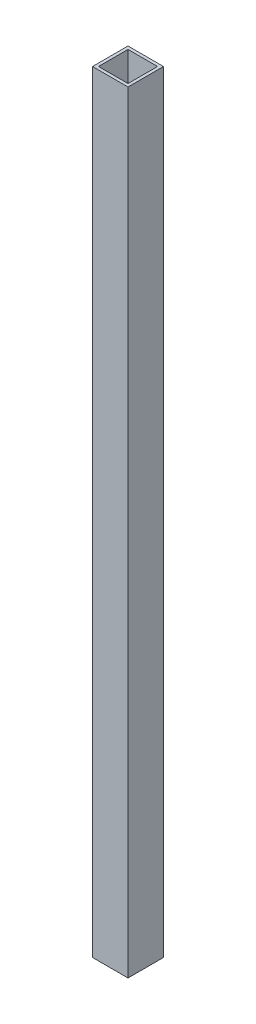
ISO-10303-21;
HEADER;
FILE_DESCRIPTION(('STEP AP214'),'2;1');
FILE_NAME('part.step','',(''),(''),'','','');
FILE_SCHEMA(('AUTOMOTIVE_DESIGN { 1 0 10303 214 1 1 1 1 }'));
ENDSEC;
DATA;
#1=APPLICATION_CONTEXT('core data for automotive mechanical design processes');
#2=APPLICATION_PROTOCOL_DEFINITION('international standard','automotive_design',2000,#1);
#3=PRODUCT_CONTEXT('',#1,'mechanical');
#4=PRODUCT('Part','Part','',(#3));
#5=PRODUCT_RELATED_PRODUCT_CATEGORY('part','',(#4));
#6=PRODUCT_DEFINITION_FORMATION('','',#4);
#7=PRODUCT_DEFINITION_CONTEXT('part definition',#1,'design');
#8=PRODUCT_DEFINITION('design','',#6,#7);
#9=PRODUCT_DEFINITION_SHAPE('','',#8);
#10=(LENGTH_UNIT() NAMED_UNIT(*) SI_UNIT(.MILLI.,.METRE.));
#11=(NAMED_UNIT(*) PLANE_ANGLE_UNIT() SI_UNIT($,.RADIAN.));
#12=(NAMED_UNIT(*) SI_UNIT($,.STERADIAN.) SOLID_ANGLE_UNIT());
#13=UNCERTAINTY_MEASURE_WITH_UNIT(LENGTH_MEASURE(1.E-05),#10,'distance_accuracy_value','');
#14=(GEOMETRIC_REPRESENTATION_CONTEXT(3) GLOBAL_UNCERTAINTY_ASSIGNED_CONTEXT((#13)) GLOBAL_UNIT_ASSIGNED_CONTEXT((#10,
#11,#12)) REPRESENTATION_CONTEXT('',''));
#15=CARTESIAN_POINT('',(0.,0.,0.));
#16=DIRECTION('',(0.,0.,1.));
#17=DIRECTION('',(1.,0.,0.));
#18=AXIS2_PLACEMENT_3D('',#15,#16,#17);
#19=CARTESIAN_POINT('',(0.,414.3375,0.));
#20=DIRECTION('',(0.,-1.,0.));
#21=DIRECTION('',(0.,0.,-1.));
#22=AXIS2_PLACEMENT_3D('',#19,#20,#21);
#23=PLANE('',#22);
#24=DIRECTION('',(0.,0.,1.));
#25=VECTOR('',#24,1.);
#26=CARTESIAN_POINT('',(0.,414.3375,0.));
#27=LINE('',#26,#25);
#28=CARTESIAN_POINT('',(0.,414.3375,-19.05));
#29=VERTEX_POINT('',#28);
#30=CARTESIAN_POINT('',(0.,414.3375,0.));
#31=VERTEX_POINT('',#30);
#32=EDGE_CURVE('E143',#29,#31,#27,.T.);
#33=ORIENTED_EDGE('',*,*,#32,.T.);
#34=DIRECTION('',(1.,0.,0.));
#35=VECTOR('',#34,1.);
#36=CARTESIAN_POINT('',(0.,414.3375,0.));
#37=LINE('',#36,#35);
#38=CARTESIAN_POINT('',(19.05,414.3375,0.));
#39=VERTEX_POINT('',#38);
#40=EDGE_CURVE('E146',#31,#39,#37,.T.);
#41=ORIENTED_EDGE('',*,*,#40,.T.);
#42=DIRECTION('',(0.,0.,-1.));
#43=VECTOR('',#42,1.);
#44=CARTESIAN_POINT('',(19.05,414.3375,0.));
#45=LINE('',#44,#43);
#46=CARTESIAN_POINT('',(19.05,414.3375,-19.05));
#47=VERTEX_POINT('',#46);
#48=EDGE_CURVE('E149',#39,#47,#45,.T.);
#49=ORIENTED_EDGE('',*,*,#48,.T.);
#50=DIRECTION('',(-1.,0.,0.));
#51=VECTOR('',#50,1.);
#52=CARTESIAN_POINT('',(0.,414.3375,-19.05));
#53=LINE('',#52,#51);
#54=EDGE_CURVE('E151',#47,#29,#53,.T.);
#55=ORIENTED_EDGE('',*,*,#54,.T.);
#56=EDGE_LOOP('',(#33,#41,#49,#55));
#57=FACE_BOUND('',#56,.T.);
#58=DIRECTION('',(0.,0.,1.));
#59=VECTOR('',#58,1.);
#60=CARTESIAN_POINT('',(1.5875,414.3375,-1.5875));
#61=LINE('',#60,#59);
#62=CARTESIAN_POINT('',(1.5875,414.3375,-17.4625));
#63=VERTEX_POINT('',#62);
#64=CARTESIAN_POINT('',(1.5875,414.3375,-1.5875));
#65=VERTEX_POINT('',#64);
#66=EDGE_CURVE('E103',#63,#65,#61,.T.);
#67=ORIENTED_EDGE('',*,*,#66,.F.);
#68=DIRECTION('',(-1.,0.,0.));
#69=VECTOR('',#68,1.);
#70=CARTESIAN_POINT('',(1.5875,414.3375,-17.4625));
#71=LINE('',#70,#69);
#72=CARTESIAN_POINT('',(17.4625,414.3375,-17.4625));
#73=VERTEX_POINT('',#72);
#74=EDGE_CURVE('E126',#73,#63,#71,.T.);
#75=ORIENTED_EDGE('',*,*,#74,.F.);
#76=DIRECTION('',(0.,0.,-1.));
#77=VECTOR('',#76,1.);
#78=CARTESIAN_POINT('',(17.4625,414.3375,-1.5875));
#79=LINE('',#78,#77);
#80=CARTESIAN_POINT('',(17.4625,414.3375,-1.5875));
#81=VERTEX_POINT('',#80);
#82=EDGE_CURVE('E124',#81,#73,#79,.T.);
#83=ORIENTED_EDGE('',*,*,#82,.F.);
#84=DIRECTION('',(1.,0.,0.));
#85=VECTOR('',#84,1.);
#86=CARTESIAN_POINT('',(1.5875,414.3375,-1.5875));
#87=LINE('',#86,#85);
#88=EDGE_CURVE('E111',#65,#81,#87,.T.);
#89=ORIENTED_EDGE('',*,*,#88,.F.);
#90=EDGE_LOOP('',(#67,#75,#83,#89));
#91=FACE_BOUND('',#90,.T.);
#92=ADVANCED_FACE('F37',(#57,#91),#23,.F.);
#93=CARTESIAN_POINT('',(0.,0.,0.));
#94=DIRECTION('',(0.,-1.,0.));
#95=DIRECTION('',(0.,0.,-1.));
#96=AXIS2_PLACEMENT_3D('',#93,#94,#95);
#97=PLANE('',#96);
#98=DIRECTION('',(0.,0.,1.));
#99=VECTOR('',#98,1.);
#100=CARTESIAN_POINT('',(0.,0.,0.));
#101=LINE('',#100,#99);
#102=CARTESIAN_POINT('',(0.,0.,-19.05));
#103=VERTEX_POINT('',#102);
#104=CARTESIAN_POINT('',(0.,0.,0.));
#105=VERTEX_POINT('',#104);
#106=EDGE_CURVE('E120',#103,#105,#101,.T.);
#107=ORIENTED_EDGE('',*,*,#106,.F.);
#108=DIRECTION('',(-1.,0.,0.));
#109=VECTOR('',#108,1.);
#110=CARTESIAN_POINT('',(0.,0.,-19.05));
#111=LINE('',#110,#109);
#112=CARTESIAN_POINT('',(19.05,0.,-19.05));
#113=VERTEX_POINT('',#112);
#114=EDGE_CURVE('E147',#113,#103,#111,.T.);
#115=ORIENTED_EDGE('',*,*,#114,.F.);
#116=DIRECTION('',(0.,0.,-1.));
#117=VECTOR('',#116,1.);
#118=CARTESIAN_POINT('',(19.05,0.,0.));
#119=LINE('',#118,#117);
#120=CARTESIAN_POINT('',(19.05,0.,0.));
#121=VERTEX_POINT('',#120);
#122=EDGE_CURVE('E158',#121,#113,#119,.T.);
#123=ORIENTED_EDGE('',*,*,#122,.F.);
#124=DIRECTION('',(1.,0.,0.));
#125=VECTOR('',#124,1.);
#126=CARTESIAN_POINT('',(0.,0.,0.));
#127=LINE('',#126,#125);
#128=EDGE_CURVE('E156',#105,#121,#127,.T.);
#129=ORIENTED_EDGE('',*,*,#128,.F.);
#130=EDGE_LOOP('',(#107,#115,#123,#129));
#131=FACE_BOUND('',#130,.T.);
#132=DIRECTION('',(-1.,0.,0.));
#133=VECTOR('',#132,1.);
#134=CARTESIAN_POINT('',(1.5875,0.,-17.4625));
#135=LINE('',#134,#133);
#136=CARTESIAN_POINT('',(17.4625,0.,-17.4625));
#137=VERTEX_POINT('',#136);
#138=CARTESIAN_POINT('',(1.5875,0.,-17.4625));
#139=VERTEX_POINT('',#138);
#140=EDGE_CURVE('E112',#137,#139,#135,.T.);
#141=ORIENTED_EDGE('',*,*,#140,.T.);
#142=DIRECTION('',(0.,0.,1.));
#143=VECTOR('',#142,1.);
#144=CARTESIAN_POINT('',(1.5875,0.,-1.5875));
#145=LINE('',#144,#143);
#146=CARTESIAN_POINT('',(1.5875,0.,-1.5875));
#147=VERTEX_POINT('',#146);
#148=EDGE_CURVE('E61',#139,#147,#145,.T.);
#149=ORIENTED_EDGE('',*,*,#148,.T.);
#150=DIRECTION('',(1.,0.,0.));
#151=VECTOR('',#150,1.);
#152=CARTESIAN_POINT('',(1.5875,0.,-1.5875));
#153=LINE('',#152,#151);
#154=CARTESIAN_POINT('',(17.4625,0.,-1.5875));
#155=VERTEX_POINT('',#154);
#156=EDGE_CURVE('E118',#147,#155,#153,.T.);
#157=ORIENTED_EDGE('',*,*,#156,.T.);
#158=DIRECTION('',(0.,0.,-1.));
#159=VECTOR('',#158,1.);
#160=CARTESIAN_POINT('',(17.4625,0.,-1.5875));
#161=LINE('',#160,#159);
#162=EDGE_CURVE('E132',#155,#137,#161,.T.);
#163=ORIENTED_EDGE('',*,*,#162,.T.);
#164=EDGE_LOOP('',(#141,#149,#157,#163));
#165=FACE_BOUND('',#164,.T.);
#166=ADVANCED_FACE('F179',(#131,#165),#97,.T.);
#167=CARTESIAN_POINT('',(0.,414.3375,0.));
#168=DIRECTION('',(1.,0.,0.));
#169=DIRECTION('',(0.,0.,-1.));
#170=AXIS2_PLACEMENT_3D('',#167,#168,#169);
#171=PLANE('',#170);
#172=ORIENTED_EDGE('',*,*,#106,.T.);
#173=DIRECTION('',(0.,-1.,0.));
#174=VECTOR('',#173,1.);
#175=CARTESIAN_POINT('',(0.,414.3375,0.));
#176=LINE('',#175,#174);
#177=EDGE_CURVE('E11',#31,#105,#176,.T.);
#178=ORIENTED_EDGE('',*,*,#177,.F.);
#179=ORIENTED_EDGE('',*,*,#32,.F.);
#180=DIRECTION('',(0.,-1.,0.));
#181=VECTOR('',#180,1.);
#182=CARTESIAN_POINT('',(0.,414.3375,-19.05));
#183=LINE('',#182,#181);
#184=EDGE_CURVE('E153',#29,#103,#183,.T.);
#185=ORIENTED_EDGE('',*,*,#184,.T.);
#186=EDGE_LOOP('',(#172,#178,#179,#185));
#187=FACE_BOUND('',#186,.T.);
#188=ADVANCED_FACE('F39',(#187),#171,.F.);
#189=CARTESIAN_POINT('',(0.,414.3375,0.));
#190=DIRECTION('',(0.,0.,-1.));
#191=DIRECTION('',(-1.,0.,0.));
#192=AXIS2_PLACEMENT_3D('',#189,#190,#191);
#193=PLANE('',#192);
#194=ORIENTED_EDGE('',*,*,#128,.T.);
#195=DIRECTION('',(0.,-1.,0.));
#196=VECTOR('',#195,1.);
#197=CARTESIAN_POINT('',(19.05,414.3375,0.));
#198=LINE('',#197,#196);
#199=EDGE_CURVE('E46',#39,#121,#198,.T.);
#200=ORIENTED_EDGE('',*,*,#199,.F.);
#201=ORIENTED_EDGE('',*,*,#40,.F.);
#202=ORIENTED_EDGE('',*,*,#177,.T.);
#203=EDGE_LOOP('',(#194,#200,#201,#202));
#204=FACE_BOUND('',#203,.T.);
#205=ADVANCED_FACE('F189',(#204),#193,.F.);
#206=CARTESIAN_POINT('',(19.05,414.3375,0.));
#207=DIRECTION('',(-1.,0.,0.));
#208=DIRECTION('',(0.,0.,1.));
#209=AXIS2_PLACEMENT_3D('',#206,#207,#208);
#210=PLANE('',#209);
#211=ORIENTED_EDGE('',*,*,#122,.T.);
#212=DIRECTION('',(0.,-1.,0.));
#213=VECTOR('',#212,1.);
#214=CARTESIAN_POINT('',(19.05,414.3375,-19.05));
#215=LINE('',#214,#213);
#216=EDGE_CURVE('E164',#47,#113,#215,.T.);
#217=ORIENTED_EDGE('',*,*,#216,.F.);
#218=ORIENTED_EDGE('',*,*,#48,.F.);
#219=ORIENTED_EDGE('',*,*,#199,.T.);
#220=EDGE_LOOP('',(#211,#217,#218,#219));
#221=FACE_BOUND('',#220,.T.);
#222=ADVANCED_FACE('F173',(#221),#210,.F.);
#223=CARTESIAN_POINT('',(0.,414.3375,-19.05));
#224=DIRECTION('',(0.,0.,1.));
#225=DIRECTION('',(1.,0.,0.));
#226=AXIS2_PLACEMENT_3D('',#223,#224,#225);
#227=PLANE('',#226);
#228=ORIENTED_EDGE('',*,*,#114,.T.);
#229=ORIENTED_EDGE('',*,*,#184,.F.);
#230=ORIENTED_EDGE('',*,*,#54,.F.);
#231=ORIENTED_EDGE('',*,*,#216,.T.);
#232=EDGE_LOOP('',(#228,#229,#230,#231));
#233=FACE_BOUND('',#232,.T.);
#234=ADVANCED_FACE('F183',(#233),#227,.F.);
#235=CARTESIAN_POINT('',(1.5875,414.3375,-1.5875));
#236=DIRECTION('',(1.,0.,0.));
#237=DIRECTION('',(0.,0.,-1.));
#238=AXIS2_PLACEMENT_3D('',#235,#236,#237);
#239=PLANE('',#238);
#240=ORIENTED_EDGE('',*,*,#148,.F.);
#241=DIRECTION('',(0.,-1.,0.));
#242=VECTOR('',#241,1.);
#243=CARTESIAN_POINT('',(1.5875,414.3375,-17.4625));
#244=LINE('',#243,#242);
#245=EDGE_CURVE('E107',#63,#139,#244,.T.);
#246=ORIENTED_EDGE('',*,*,#245,.F.);
#247=ORIENTED_EDGE('',*,*,#66,.T.);
#248=DIRECTION('',(0.,-1.,0.));
#249=VECTOR('',#248,1.);
#250=CARTESIAN_POINT('',(1.5875,414.3375,-1.5875));
#251=LINE('',#250,#249);
#252=EDGE_CURVE('E106',#65,#147,#251,.T.);
#253=ORIENTED_EDGE('',*,*,#252,.T.);
#254=EDGE_LOOP('',(#240,#246,#247,#253));
#255=FACE_BOUND('',#254,.T.);
#256=ADVANCED_FACE('F105',(#255),#239,.T.);
#257=CARTESIAN_POINT('',(1.5875,414.3375,-1.5875));
#258=DIRECTION('',(0.,0.,-1.));
#259=DIRECTION('',(-1.,0.,0.));
#260=AXIS2_PLACEMENT_3D('',#257,#258,#259);
#261=PLANE('',#260);
#262=ORIENTED_EDGE('',*,*,#156,.F.);
#263=ORIENTED_EDGE('',*,*,#252,.F.);
#264=ORIENTED_EDGE('',*,*,#88,.T.);
#265=DIRECTION('',(0.,-1.,0.));
#266=VECTOR('',#265,1.);
#267=CARTESIAN_POINT('',(17.4625,414.3375,-1.5875));
#268=LINE('',#267,#266);
#269=EDGE_CURVE('E121',#81,#155,#268,.T.);
#270=ORIENTED_EDGE('',*,*,#269,.T.);
#271=EDGE_LOOP('',(#262,#263,#264,#270));
#272=FACE_BOUND('',#271,.T.);
#273=ADVANCED_FACE('F115',(#272),#261,.T.);
#274=CARTESIAN_POINT('',(17.4625,414.3375,-1.5875));
#275=DIRECTION('',(-1.,0.,0.));
#276=DIRECTION('',(0.,0.,1.));
#277=AXIS2_PLACEMENT_3D('',#274,#275,#276);
#278=PLANE('',#277);
#279=ORIENTED_EDGE('',*,*,#162,.F.);
#280=ORIENTED_EDGE('',*,*,#269,.F.);
#281=ORIENTED_EDGE('',*,*,#82,.T.);
#282=DIRECTION('',(0.,-1.,0.));
#283=VECTOR('',#282,1.);
#284=CARTESIAN_POINT('',(17.4625,414.3375,-17.4625));
#285=LINE('',#284,#283);
#286=EDGE_CURVE('E53',#73,#137,#285,.T.);
#287=ORIENTED_EDGE('',*,*,#286,.T.);
#288=EDGE_LOOP('',(#279,#280,#281,#287));
#289=FACE_BOUND('',#288,.T.);
#290=ADVANCED_FACE('F212',(#289),#278,.T.);
#291=CARTESIAN_POINT('',(1.5875,414.3375,-17.4625));
#292=DIRECTION('',(0.,0.,1.));
#293=DIRECTION('',(1.,0.,0.));
#294=AXIS2_PLACEMENT_3D('',#291,#292,#293);
#295=PLANE('',#294);
#296=ORIENTED_EDGE('',*,*,#140,.F.);
#297=ORIENTED_EDGE('',*,*,#286,.F.);
#298=ORIENTED_EDGE('',*,*,#74,.T.);
#299=ORIENTED_EDGE('',*,*,#245,.T.);
#300=EDGE_LOOP('',(#296,#297,#298,#299));
#301=FACE_BOUND('',#300,.T.);
#302=ADVANCED_FACE('F216',(#301),#295,.T.);
#303=CLOSED_SHELL('',(#92,#166,#188,#205,#222,#234,#256,#273,#290,#302));
#304=MANIFOLD_SOLID_BREP('B2',#303);
#305=ADVANCED_BREP_SHAPE_REPRESENTATION('',(#18,#304),#14);
#306=SHAPE_DEFINITION_REPRESENTATION(#9,#305);
ENDSEC;
END-ISO-10303-21;
